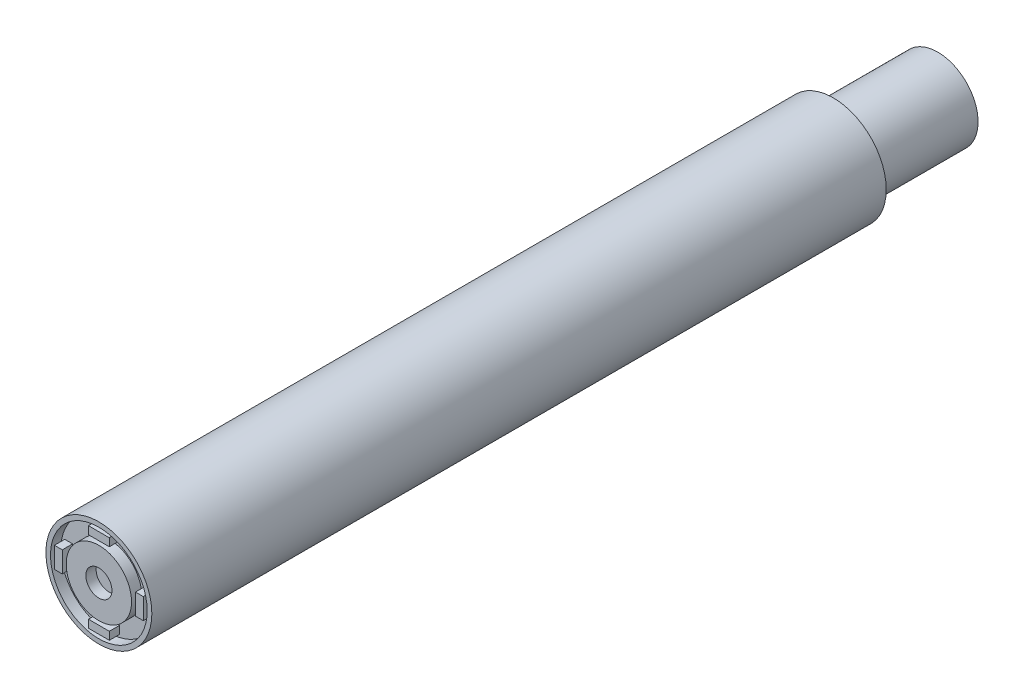
ISO-10303-21;
HEADER;
FILE_DESCRIPTION(('STEP AP214'),'2;1');
FILE_NAME('part.step','',(''),(''),'','','');
FILE_SCHEMA(('AUTOMOTIVE_DESIGN { 1 0 10303 214 1 1 1 1 }'));
ENDSEC;
DATA;
#1=APPLICATION_CONTEXT('core data for automotive mechanical design processes');
#2=APPLICATION_PROTOCOL_DEFINITION('international standard','automotive_design',2000,#1);
#3=PRODUCT_CONTEXT('',#1,'mechanical');
#4=PRODUCT('Part','Part','',(#3));
#5=PRODUCT_RELATED_PRODUCT_CATEGORY('part','',(#4));
#6=PRODUCT_DEFINITION_FORMATION('','',#4);
#7=PRODUCT_DEFINITION_CONTEXT('part definition',#1,'design');
#8=PRODUCT_DEFINITION('design','',#6,#7);
#9=PRODUCT_DEFINITION_SHAPE('','',#8);
#10=(LENGTH_UNIT() NAMED_UNIT(*) SI_UNIT(.MILLI.,.METRE.));
#11=(NAMED_UNIT(*) PLANE_ANGLE_UNIT() SI_UNIT($,.RADIAN.));
#12=(NAMED_UNIT(*) SI_UNIT($,.STERADIAN.) SOLID_ANGLE_UNIT());
#13=UNCERTAINTY_MEASURE_WITH_UNIT(LENGTH_MEASURE(1.E-05),#10,'distance_accuracy_value','');
#14=(GEOMETRIC_REPRESENTATION_CONTEXT(3) GLOBAL_UNCERTAINTY_ASSIGNED_CONTEXT((#13)) GLOBAL_UNIT_ASSIGNED_CONTEXT((#10,
#11,#12)) REPRESENTATION_CONTEXT('',''));
#15=CARTESIAN_POINT('',(0.,0.,0.));
#16=DIRECTION('',(0.,0.,1.));
#17=DIRECTION('',(1.,0.,0.));
#18=AXIS2_PLACEMENT_3D('',#15,#16,#17);
#19=CARTESIAN_POINT('',(0.,0.,-35.7));
#20=DIRECTION('',(0.,0.,1.));
#21=DIRECTION('',(1.,0.,0.));
#22=AXIS2_PLACEMENT_3D('',#19,#20,#21);
#23=CYLINDRICAL_SURFACE('',#22,2.57499999999999);
#24=CARTESIAN_POINT('',(0.,0.,-35.7));
#25=DIRECTION('',(0.,0.,1.));
#26=DIRECTION('',(1.,0.,0.));
#27=AXIS2_PLACEMENT_3D('',#24,#25,#26);
#28=CIRCLE('',#27,2.57499999999999);
#29=CARTESIAN_POINT('',(2.57499999999999,0.,-35.7));
#30=VERTEX_POINT('',#29);
#31=EDGE_CURVE('E298',#30,#30,#28,.T.);
#32=ORIENTED_EDGE('',*,*,#31,.T.);
#33=EDGE_LOOP('',(#32));
#34=FACE_BOUND('',#33,.T.);
#35=CARTESIAN_POINT('',(0.,0.,0.));
#36=DIRECTION('',(0.,0.,1.));
#37=DIRECTION('',(1.,0.,0.));
#38=AXIS2_PLACEMENT_3D('',#35,#36,#37);
#39=CIRCLE('',#38,2.57499999999999);
#40=CARTESIAN_POINT('',(2.57499999999999,0.,0.));
#41=VERTEX_POINT('',#40);
#42=EDGE_CURVE('E293',#41,#41,#39,.T.);
#43=ORIENTED_EDGE('',*,*,#42,.F.);
#44=EDGE_LOOP('',(#43));
#45=FACE_BOUND('',#44,.T.);
#46=ADVANCED_FACE('F41',(#34,#45),#23,.T.);
#47=CARTESIAN_POINT('',(0.,0.,-35.7));
#48=DIRECTION('',(0.,0.,1.));
#49=DIRECTION('',(1.,0.,0.));
#50=AXIS2_PLACEMENT_3D('',#47,#48,#49);
#51=PLANE('',#50);
#52=CARTESIAN_POINT('',(0.,0.,-35.7));
#53=DIRECTION('',(0.,0.,-1.));
#54=DIRECTION('',(-1.,0.,0.));
#55=AXIS2_PLACEMENT_3D('',#52,#53,#54);
#56=CIRCLE('',#55,1.9588);
#57=CARTESIAN_POINT('',(-1.9588,0.,-35.7));
#58=VERTEX_POINT('',#57);
#59=EDGE_CURVE('E11',#58,#58,#56,.T.);
#60=ORIENTED_EDGE('',*,*,#59,.F.);
#61=EDGE_LOOP('',(#60));
#62=FACE_BOUND('',#61,.T.);
#63=ORIENTED_EDGE('',*,*,#31,.F.);
#64=EDGE_LOOP('',(#63));
#65=FACE_BOUND('',#64,.T.);
#66=ADVANCED_FACE('F394',(#62,#65),#51,.F.);
#67=CARTESIAN_POINT('',(0.,0.,0.));
#68=DIRECTION('',(0.,0.,1.));
#69=DIRECTION('',(1.,0.,0.));
#70=AXIS2_PLACEMENT_3D('',#67,#68,#69);
#71=PLANE('',#70);
#72=CARTESIAN_POINT('',(0.,0.,0.));
#73=DIRECTION('',(0.,0.,1.));
#74=DIRECTION('',(1.,0.,0.));
#75=AXIS2_PLACEMENT_3D('',#72,#73,#74);
#76=CIRCLE('',#75,2.35);
#77=CARTESIAN_POINT('',(2.35,0.,0.));
#78=VERTEX_POINT('',#77);
#79=EDGE_CURVE('E294',#78,#78,#76,.T.);
#80=ORIENTED_EDGE('',*,*,#79,.F.);
#81=EDGE_LOOP('',(#80));
#82=FACE_BOUND('',#81,.T.);
#83=ORIENTED_EDGE('',*,*,#42,.T.);
#84=EDGE_LOOP('',(#83));
#85=FACE_BOUND('',#84,.T.);
#86=ADVANCED_FACE('F388',(#82,#85),#71,.T.);
#87=CARTESIAN_POINT('',(0.,0.,-0.5));
#88=DIRECTION('',(0.,0.,1.));
#89=DIRECTION('',(1.,0.,0.));
#90=AXIS2_PLACEMENT_3D('',#87,#88,#89);
#91=CYLINDRICAL_SURFACE('',#90,2.35);
#92=CARTESIAN_POINT('',(0.,0.,-0.5));
#93=DIRECTION('',(0.,0.,1.));
#94=DIRECTION('',(1.,0.,0.));
#95=AXIS2_PLACEMENT_3D('',#92,#93,#94);
#96=CIRCLE('',#95,2.35);
#97=CARTESIAN_POINT('',(2.35,0.,-0.5));
#98=VERTEX_POINT('',#97);
#99=EDGE_CURVE('E289',#98,#98,#96,.T.);
#100=ORIENTED_EDGE('',*,*,#99,.F.);
#101=EDGE_LOOP('',(#100));
#102=FACE_BOUND('',#101,.T.);
#103=ORIENTED_EDGE('',*,*,#79,.T.);
#104=EDGE_LOOP('',(#103));
#105=FACE_BOUND('',#104,.T.);
#106=ADVANCED_FACE('F376',(#102,#105),#91,.F.);
#107=CARTESIAN_POINT('',(0.,0.,-0.5));
#108=DIRECTION('',(0.,0.,1.));
#109=DIRECTION('',(1.,0.,0.));
#110=AXIS2_PLACEMENT_3D('',#107,#108,#109);
#111=PLANE('',#110);
#112=DIRECTION('',(0.,1.,0.));
#113=VECTOR('',#112,1.);
#114=CARTESIAN_POINT('',(2.159,0.,-0.5));
#115=LINE('',#114,#113);
#116=CARTESIAN_POINT('',(2.159,-0.508,-0.5));
#117=VERTEX_POINT('',#116);
#118=CARTESIAN_POINT('',(2.159,0.508,-0.5));
#119=VERTEX_POINT('',#118);
#120=EDGE_CURVE('E44',#117,#119,#115,.T.);
#121=ORIENTED_EDGE('',*,*,#120,.F.);
#122=DIRECTION('',(1.,0.,0.));
#123=VECTOR('',#122,1.);
#124=CARTESIAN_POINT('',(0.,-0.508,-0.5));
#125=LINE('',#124,#123);
#126=CARTESIAN_POINT('',(1.778,-0.508,-0.5));
#127=VERTEX_POINT('',#126);
#128=EDGE_CURVE('E60',#127,#117,#125,.T.);
#129=ORIENTED_EDGE('',*,*,#128,.F.);
#130=DIRECTION('',(0.,-1.,0.));
#131=VECTOR('',#130,1.);
#132=CARTESIAN_POINT('',(1.778,0.,-0.5));
#133=LINE('',#132,#131);
#134=CARTESIAN_POINT('',(1.778,0.508,-0.5));
#135=VERTEX_POINT('',#134);
#136=EDGE_CURVE('E363',#135,#127,#133,.T.);
#137=ORIENTED_EDGE('',*,*,#136,.F.);
#138=DIRECTION('',(-1.,0.,0.));
#139=VECTOR('',#138,1.);
#140=CARTESIAN_POINT('',(0.,0.508,-0.5));
#141=LINE('',#140,#139);
#142=EDGE_CURVE('E360',#119,#135,#141,.T.);
#143=ORIENTED_EDGE('',*,*,#142,.F.);
#144=EDGE_LOOP('',(#121,#129,#137,#143));
#145=FACE_BOUND('',#144,.T.);
#146=DIRECTION('',(0.,1.,0.));
#147=VECTOR('',#146,1.);
#148=CARTESIAN_POINT('',(-1.778,0.,-0.5));
#149=LINE('',#148,#147);
#150=CARTESIAN_POINT('',(-1.778,-0.508,-0.5));
#151=VERTEX_POINT('',#150);
#152=CARTESIAN_POINT('',(-1.778,0.508,-0.5));
#153=VERTEX_POINT('',#152);
#154=EDGE_CURVE('E356',#151,#153,#149,.T.);
#155=ORIENTED_EDGE('',*,*,#154,.F.);
#156=DIRECTION('',(1.,0.,0.));
#157=VECTOR('',#156,1.);
#158=CARTESIAN_POINT('',(0.,-0.508,-0.5));
#159=LINE('',#158,#157);
#160=CARTESIAN_POINT('',(-2.159,-0.508,-0.5));
#161=VERTEX_POINT('',#160);
#162=EDGE_CURVE('E352',#161,#151,#159,.T.);
#163=ORIENTED_EDGE('',*,*,#162,.F.);
#164=DIRECTION('',(0.,-1.,0.));
#165=VECTOR('',#164,1.);
#166=CARTESIAN_POINT('',(-2.159,0.,-0.5));
#167=LINE('',#166,#165);
#168=CARTESIAN_POINT('',(-2.159,0.508,-0.5));
#169=VERTEX_POINT('',#168);
#170=EDGE_CURVE('E348',#169,#161,#167,.T.);
#171=ORIENTED_EDGE('',*,*,#170,.F.);
#172=DIRECTION('',(-1.,0.,0.));
#173=VECTOR('',#172,1.);
#174=CARTESIAN_POINT('',(0.,0.508,-0.5));
#175=LINE('',#174,#173);
#176=EDGE_CURVE('E344',#153,#169,#175,.T.);
#177=ORIENTED_EDGE('',*,*,#176,.F.);
#178=EDGE_LOOP('',(#155,#163,#171,#177));
#179=FACE_BOUND('',#178,.T.);
#180=DIRECTION('',(0.,1.,0.));
#181=VECTOR('',#180,1.);
#182=CARTESIAN_POINT('',(0.508,0.,-0.5));
#183=LINE('',#182,#181);
#184=CARTESIAN_POINT('',(0.508,-2.159,-0.5));
#185=VERTEX_POINT('',#184);
#186=CARTESIAN_POINT('',(0.508,-1.778,-0.5));
#187=VERTEX_POINT('',#186);
#188=EDGE_CURVE('E340',#185,#187,#183,.T.);
#189=ORIENTED_EDGE('',*,*,#188,.F.);
#190=DIRECTION('',(1.,0.,0.));
#191=VECTOR('',#190,1.);
#192=CARTESIAN_POINT('',(0.,-2.159,-0.5));
#193=LINE('',#192,#191);
#194=CARTESIAN_POINT('',(-0.508,-2.159,-0.5));
#195=VERTEX_POINT('',#194);
#196=EDGE_CURVE('E336',#195,#185,#193,.T.);
#197=ORIENTED_EDGE('',*,*,#196,.F.);
#198=DIRECTION('',(0.,-1.,0.));
#199=VECTOR('',#198,1.);
#200=CARTESIAN_POINT('',(-0.508,0.,-0.5));
#201=LINE('',#200,#199);
#202=CARTESIAN_POINT('',(-0.508,-1.778,-0.5));
#203=VERTEX_POINT('',#202);
#204=EDGE_CURVE('E332',#203,#195,#201,.T.);
#205=ORIENTED_EDGE('',*,*,#204,.F.);
#206=DIRECTION('',(-1.,0.,0.));
#207=VECTOR('',#206,1.);
#208=CARTESIAN_POINT('',(0.,-1.778,-0.5));
#209=LINE('',#208,#207);
#210=EDGE_CURVE('E328',#187,#203,#209,.T.);
#211=ORIENTED_EDGE('',*,*,#210,.F.);
#212=EDGE_LOOP('',(#189,#197,#205,#211));
#213=FACE_BOUND('',#212,.T.);
#214=DIRECTION('',(0.,1.,0.));
#215=VECTOR('',#214,1.);
#216=CARTESIAN_POINT('',(0.508000000000001,0.,-0.5));
#217=LINE('',#216,#215);
#218=CARTESIAN_POINT('',(0.508000000000001,1.778,-0.5));
#219=VERTEX_POINT('',#218);
#220=CARTESIAN_POINT('',(0.508000000000001,2.159,-0.5));
#221=VERTEX_POINT('',#220);
#222=EDGE_CURVE('E324',#219,#221,#217,.T.);
#223=ORIENTED_EDGE('',*,*,#222,.F.);
#224=DIRECTION('',(1.,0.,0.));
#225=VECTOR('',#224,1.);
#226=CARTESIAN_POINT('',(0.,1.778,-0.5));
#227=LINE('',#226,#225);
#228=CARTESIAN_POINT('',(-0.507999999999999,1.778,-0.5));
#229=VERTEX_POINT('',#228);
#230=EDGE_CURVE('E320',#229,#219,#227,.T.);
#231=ORIENTED_EDGE('',*,*,#230,.F.);
#232=DIRECTION('',(0.,-1.,0.));
#233=VECTOR('',#232,1.);
#234=CARTESIAN_POINT('',(-0.507999999999999,0.,-0.5));
#235=LINE('',#234,#233);
#236=CARTESIAN_POINT('',(-0.507999999999999,2.159,-0.5));
#237=VERTEX_POINT('',#236);
#238=EDGE_CURVE('E316',#237,#229,#235,.T.);
#239=ORIENTED_EDGE('',*,*,#238,.F.);
#240=DIRECTION('',(-1.,0.,0.));
#241=VECTOR('',#240,1.);
#242=CARTESIAN_POINT('',(0.,2.159,-0.5));
#243=LINE('',#242,#241);
#244=EDGE_CURVE('E312',#221,#237,#243,.T.);
#245=ORIENTED_EDGE('',*,*,#244,.F.);
#246=EDGE_LOOP('',(#223,#231,#239,#245));
#247=FACE_BOUND('',#246,.T.);
#248=CARTESIAN_POINT('',(0.,0.,-0.5));
#249=DIRECTION('',(0.,0.,1.));
#250=DIRECTION('',(1.,0.,0.));
#251=AXIS2_PLACEMENT_3D('',#248,#249,#250);
#252=CIRCLE('',#251,1.5875);
#253=CARTESIAN_POINT('',(1.5875,0.,-0.5));
#254=VERTEX_POINT('',#253);
#255=EDGE_CURVE('E302',#254,#254,#252,.T.);
#256=ORIENTED_EDGE('',*,*,#255,.F.);
#257=EDGE_LOOP('',(#256));
#258=FACE_BOUND('',#257,.T.);
#259=ORIENTED_EDGE('',*,*,#99,.T.);
#260=EDGE_LOOP('',(#259));
#261=FACE_BOUND('',#260,.T.);
#262=ADVANCED_FACE('F372',(#145,#179,#213,#247,#258,#261),#111,.T.);
#263=CARTESIAN_POINT('',(0.,0.,-0.508));
#264=DIRECTION('',(0.,0.,1.));
#265=DIRECTION('',(1.,0.,0.));
#266=AXIS2_PLACEMENT_3D('',#263,#264,#265);
#267=CYLINDRICAL_SURFACE('',#266,1.5875);
#268=ORIENTED_EDGE('',*,*,#255,.T.);
#269=EDGE_LOOP('',(#268));
#270=FACE_BOUND('',#269,.T.);
#271=CARTESIAN_POINT('',(0.,0.,0.));
#272=DIRECTION('',(0.,0.,1.));
#273=DIRECTION('',(1.,0.,0.));
#274=AXIS2_PLACEMENT_3D('',#271,#272,#273);
#275=CIRCLE('',#274,1.5875);
#276=CARTESIAN_POINT('',(1.5875,0.,0.));
#277=VERTEX_POINT('',#276);
#278=EDGE_CURVE('E284',#277,#277,#275,.T.);
#279=ORIENTED_EDGE('',*,*,#278,.F.);
#280=EDGE_LOOP('',(#279));
#281=FACE_BOUND('',#280,.T.);
#282=ADVANCED_FACE('F375',(#270,#281),#267,.T.);
#283=CARTESIAN_POINT('',(0.,0.,0.));
#284=DIRECTION('',(0.,0.,1.));
#285=DIRECTION('',(1.,0.,0.));
#286=AXIS2_PLACEMENT_3D('',#283,#284,#285);
#287=PLANE('',#286);
#288=CARTESIAN_POINT('',(0.,0.,0.));
#289=DIRECTION('',(0.,0.,1.));
#290=DIRECTION('',(1.,0.,0.));
#291=AXIS2_PLACEMENT_3D('',#288,#289,#290);
#292=CIRCLE('',#291,0.635);
#293=CARTESIAN_POINT('',(0.635,0.,0.));
#294=VERTEX_POINT('',#293);
#295=EDGE_CURVE('E272',#294,#294,#292,.T.);
#296=ORIENTED_EDGE('',*,*,#295,.F.);
#297=EDGE_LOOP('',(#296));
#298=FACE_BOUND('',#297,.T.);
#299=ORIENTED_EDGE('',*,*,#278,.T.);
#300=EDGE_LOOP('',(#299));
#301=FACE_BOUND('',#300,.T.);
#302=ADVANCED_FACE('F412',(#298,#301),#287,.T.);
#303=CARTESIAN_POINT('',(0.,0.,-0.508));
#304=DIRECTION('',(0.,0.,1.));
#305=DIRECTION('',(1.,0.,0.));
#306=AXIS2_PLACEMENT_3D('',#303,#304,#305);
#307=CYLINDRICAL_SURFACE('',#306,0.635);
#308=CARTESIAN_POINT('',(0.,0.,-0.5));
#309=DIRECTION('',(0.,0.,1.));
#310=DIRECTION('',(1.,0.,0.));
#311=AXIS2_PLACEMENT_3D('',#308,#309,#310);
#312=CIRCLE('',#311,0.635);
#313=CARTESIAN_POINT('',(0.635,0.,-0.5));
#314=VERTEX_POINT('',#313);
#315=EDGE_CURVE('E288',#314,#314,#312,.T.);
#316=ORIENTED_EDGE('',*,*,#315,.F.);
#317=EDGE_LOOP('',(#316));
#318=FACE_BOUND('',#317,.T.);
#319=ORIENTED_EDGE('',*,*,#295,.T.);
#320=EDGE_LOOP('',(#319));
#321=FACE_BOUND('',#320,.T.);
#322=ADVANCED_FACE('F416',(#318,#321),#307,.F.);
#323=ORIENTED_EDGE('',*,*,#315,.T.);
#324=EDGE_LOOP('',(#323));
#325=FACE_BOUND('',#324,.T.);
#326=ADVANCED_FACE('F378',(#325),#111,.T.);
#327=CARTESIAN_POINT('',(0.508000000000001,1.778,-0.508));
#328=DIRECTION('',(1.,0.,0.));
#329=DIRECTION('',(0.,0.,-1.));
#330=AXIS2_PLACEMENT_3D('',#327,#328,#329);
#331=PLANE('',#330);
#332=DIRECTION('',(0.,0.,1.));
#333=VECTOR('',#332,1.);
#334=CARTESIAN_POINT('',(0.508000000000001,1.778,-0.508));
#335=LINE('',#334,#333);
#336=CARTESIAN_POINT('',(0.508000000000001,1.778,0.));
#337=VERTEX_POINT('',#336);
#338=EDGE_CURVE('E269',#219,#337,#335,.T.);
#339=ORIENTED_EDGE('',*,*,#338,.F.);
#340=ORIENTED_EDGE('',*,*,#222,.T.);
#341=DIRECTION('',(0.,0.,1.));
#342=VECTOR('',#341,1.);
#343=CARTESIAN_POINT('',(0.508000000000001,2.159,-0.508));
#344=LINE('',#343,#342);
#345=CARTESIAN_POINT('',(0.508000000000001,2.159,0.));
#346=VERTEX_POINT('',#345);
#347=EDGE_CURVE('E268',#221,#346,#344,.T.);
#348=ORIENTED_EDGE('',*,*,#347,.T.);
#349=DIRECTION('',(0.,1.,0.));
#350=VECTOR('',#349,1.);
#351=CARTESIAN_POINT('',(0.508000000000001,1.778,0.));
#352=LINE('',#351,#350);
#353=EDGE_CURVE('E244',#337,#346,#352,.T.);
#354=ORIENTED_EDGE('',*,*,#353,.F.);
#355=EDGE_LOOP('',(#339,#340,#348,#354));
#356=FACE_BOUND('',#355,.T.);
#357=ADVANCED_FACE('F421',(#356),#331,.T.);
#358=CARTESIAN_POINT('',(-0.507999999999999,1.778,-0.508));
#359=DIRECTION('',(0.,-1.,0.));
#360=DIRECTION('',(0.,0.,-1.));
#361=AXIS2_PLACEMENT_3D('',#358,#359,#360);
#362=PLANE('',#361);
#363=DIRECTION('',(0.,0.,1.));
#364=VECTOR('',#363,1.);
#365=CARTESIAN_POINT('',(-0.507999999999999,1.778,-0.508));
#366=LINE('',#365,#364);
#367=CARTESIAN_POINT('',(-0.507999999999999,1.778,0.));
#368=VERTEX_POINT('',#367);
#369=EDGE_CURVE('E273',#229,#368,#366,.T.);
#370=ORIENTED_EDGE('',*,*,#369,.F.);
#371=ORIENTED_EDGE('',*,*,#230,.T.);
#372=ORIENTED_EDGE('',*,*,#338,.T.);
#373=DIRECTION('',(1.,0.,0.));
#374=VECTOR('',#373,1.);
#375=CARTESIAN_POINT('',(-0.507999999999999,1.778,0.));
#376=LINE('',#375,#374);
#377=EDGE_CURVE('E264',#368,#337,#376,.T.);
#378=ORIENTED_EDGE('',*,*,#377,.F.);
#379=EDGE_LOOP('',(#370,#371,#372,#378));
#380=FACE_BOUND('',#379,.T.);
#381=ADVANCED_FACE('F424',(#380),#362,.T.);
#382=CARTESIAN_POINT('',(-0.507999999999999,1.778,-0.508));
#383=DIRECTION('',(-1.,0.,0.));
#384=DIRECTION('',(0.,0.,1.));
#385=AXIS2_PLACEMENT_3D('',#382,#383,#384);
#386=PLANE('',#385);
#387=DIRECTION('',(0.,0.,1.));
#388=VECTOR('',#387,1.);
#389=CARTESIAN_POINT('',(-0.507999999999999,2.159,-0.508));
#390=LINE('',#389,#388);
#391=CARTESIAN_POINT('',(-0.507999999999999,2.159,0.));
#392=VERTEX_POINT('',#391);
#393=EDGE_CURVE('E276',#237,#392,#390,.T.);
#394=ORIENTED_EDGE('',*,*,#393,.F.);
#395=ORIENTED_EDGE('',*,*,#238,.T.);
#396=ORIENTED_EDGE('',*,*,#369,.T.);
#397=DIRECTION('',(0.,-1.,0.));
#398=VECTOR('',#397,1.);
#399=CARTESIAN_POINT('',(-0.507999999999999,1.778,0.));
#400=LINE('',#399,#398);
#401=EDGE_CURVE('E260',#392,#368,#400,.T.);
#402=ORIENTED_EDGE('',*,*,#401,.F.);
#403=EDGE_LOOP('',(#394,#395,#396,#402));
#404=FACE_BOUND('',#403,.T.);
#405=ADVANCED_FACE('F430',(#404),#386,.T.);
#406=CARTESIAN_POINT('',(-0.507999999999999,2.159,-0.508));
#407=DIRECTION('',(0.,1.,0.));
#408=DIRECTION('',(0.,0.,1.));
#409=AXIS2_PLACEMENT_3D('',#406,#407,#408);
#410=PLANE('',#409);
#411=ORIENTED_EDGE('',*,*,#347,.F.);
#412=ORIENTED_EDGE('',*,*,#244,.T.);
#413=ORIENTED_EDGE('',*,*,#393,.T.);
#414=DIRECTION('',(-1.,0.,0.));
#415=VECTOR('',#414,1.);
#416=CARTESIAN_POINT('',(-0.507999999999999,2.159,0.));
#417=LINE('',#416,#415);
#418=EDGE_CURVE('E256',#346,#392,#417,.T.);
#419=ORIENTED_EDGE('',*,*,#418,.F.);
#420=EDGE_LOOP('',(#411,#412,#413,#419));
#421=FACE_BOUND('',#420,.T.);
#422=ADVANCED_FACE('F426',(#421),#410,.T.);
#423=CARTESIAN_POINT('',(0.,0.,0.));
#424=DIRECTION('',(0.,0.,-1.));
#425=DIRECTION('',(-1.,0.,0.));
#426=AXIS2_PLACEMENT_3D('',#423,#424,#425);
#427=PLANE('',#426);
#428=ORIENTED_EDGE('',*,*,#353,.T.);
#429=ORIENTED_EDGE('',*,*,#418,.T.);
#430=ORIENTED_EDGE('',*,*,#401,.T.);
#431=ORIENTED_EDGE('',*,*,#377,.T.);
#432=EDGE_LOOP('',(#428,#429,#430,#431));
#433=FACE_BOUND('',#432,.T.);
#434=ADVANCED_FACE('F429',(#433),#427,.F.);
#435=CARTESIAN_POINT('',(0.508,-2.159,-0.508));
#436=DIRECTION('',(1.,0.,0.));
#437=DIRECTION('',(0.,0.,-1.));
#438=AXIS2_PLACEMENT_3D('',#435,#436,#437);
#439=PLANE('',#438);
#440=DIRECTION('',(0.,0.,1.));
#441=VECTOR('',#440,1.);
#442=CARTESIAN_POINT('',(0.508,-2.159,-0.508));
#443=LINE('',#442,#441);
#444=CARTESIAN_POINT('',(0.508,-2.159,0.));
#445=VERTEX_POINT('',#444);
#446=EDGE_CURVE('E241',#185,#445,#443,.T.);
#447=ORIENTED_EDGE('',*,*,#446,.F.);
#448=ORIENTED_EDGE('',*,*,#188,.T.);
#449=DIRECTION('',(0.,0.,1.));
#450=VECTOR('',#449,1.);
#451=CARTESIAN_POINT('',(0.508,-1.778,-0.508));
#452=LINE('',#451,#450);
#453=CARTESIAN_POINT('',(0.508,-1.778,0.));
#454=VERTEX_POINT('',#453);
#455=EDGE_CURVE('E240',#187,#454,#452,.T.);
#456=ORIENTED_EDGE('',*,*,#455,.T.);
#457=DIRECTION('',(0.,1.,0.));
#458=VECTOR('',#457,1.);
#459=CARTESIAN_POINT('',(0.508,-2.159,0.));
#460=LINE('',#459,#458);
#461=EDGE_CURVE('E216',#445,#454,#460,.T.);
#462=ORIENTED_EDGE('',*,*,#461,.F.);
#463=EDGE_LOOP('',(#447,#448,#456,#462));
#464=FACE_BOUND('',#463,.T.);
#465=ADVANCED_FACE('F440',(#464),#439,.T.);
#466=CARTESIAN_POINT('',(-0.508,-2.159,-0.508));
#467=DIRECTION('',(0.,-1.,0.));
#468=DIRECTION('',(0.,0.,-1.));
#469=AXIS2_PLACEMENT_3D('',#466,#467,#468);
#470=PLANE('',#469);
#471=DIRECTION('',(0.,0.,1.));
#472=VECTOR('',#471,1.);
#473=CARTESIAN_POINT('',(-0.508,-2.159,-0.508));
#474=LINE('',#473,#472);
#475=CARTESIAN_POINT('',(-0.508,-2.159,0.));
#476=VERTEX_POINT('',#475);
#477=EDGE_CURVE('E245',#195,#476,#474,.T.);
#478=ORIENTED_EDGE('',*,*,#477,.F.);
#479=ORIENTED_EDGE('',*,*,#196,.T.);
#480=ORIENTED_EDGE('',*,*,#446,.T.);
#481=DIRECTION('',(1.,0.,0.));
#482=VECTOR('',#481,1.);
#483=CARTESIAN_POINT('',(-0.508,-2.159,0.));
#484=LINE('',#483,#482);
#485=EDGE_CURVE('E236',#476,#445,#484,.T.);
#486=ORIENTED_EDGE('',*,*,#485,.F.);
#487=EDGE_LOOP('',(#478,#479,#480,#486));
#488=FACE_BOUND('',#487,.T.);
#489=ADVANCED_FACE('F444',(#488),#470,.T.);
#490=CARTESIAN_POINT('',(-0.508,-2.159,-0.508));
#491=DIRECTION('',(-1.,0.,0.));
#492=DIRECTION('',(0.,0.,1.));
#493=AXIS2_PLACEMENT_3D('',#490,#491,#492);
#494=PLANE('',#493);
#495=DIRECTION('',(0.,0.,1.));
#496=VECTOR('',#495,1.);
#497=CARTESIAN_POINT('',(-0.508,-1.778,-0.508));
#498=LINE('',#497,#496);
#499=CARTESIAN_POINT('',(-0.508,-1.778,0.));
#500=VERTEX_POINT('',#499);
#501=EDGE_CURVE('E248',#203,#500,#498,.T.);
#502=ORIENTED_EDGE('',*,*,#501,.F.);
#503=ORIENTED_EDGE('',*,*,#204,.T.);
#504=ORIENTED_EDGE('',*,*,#477,.T.);
#505=DIRECTION('',(0.,-1.,0.));
#506=VECTOR('',#505,1.);
#507=CARTESIAN_POINT('',(-0.508,-2.159,0.));
#508=LINE('',#507,#506);
#509=EDGE_CURVE('E232',#500,#476,#508,.T.);
#510=ORIENTED_EDGE('',*,*,#509,.F.);
#511=EDGE_LOOP('',(#502,#503,#504,#510));
#512=FACE_BOUND('',#511,.T.);
#513=ADVANCED_FACE('F450',(#512),#494,.T.);
#514=CARTESIAN_POINT('',(-0.508,-1.778,-0.508));
#515=DIRECTION('',(0.,1.,0.));
#516=DIRECTION('',(0.,0.,1.));
#517=AXIS2_PLACEMENT_3D('',#514,#515,#516);
#518=PLANE('',#517);
#519=ORIENTED_EDGE('',*,*,#455,.F.);
#520=ORIENTED_EDGE('',*,*,#210,.T.);
#521=ORIENTED_EDGE('',*,*,#501,.T.);
#522=DIRECTION('',(-1.,0.,0.));
#523=VECTOR('',#522,1.);
#524=CARTESIAN_POINT('',(-0.508,-1.778,0.));
#525=LINE('',#524,#523);
#526=EDGE_CURVE('E228',#454,#500,#525,.T.);
#527=ORIENTED_EDGE('',*,*,#526,.F.);
#528=EDGE_LOOP('',(#519,#520,#521,#527));
#529=FACE_BOUND('',#528,.T.);
#530=ADVANCED_FACE('F446',(#529),#518,.T.);
#531=CARTESIAN_POINT('',(0.,0.,0.));
#532=DIRECTION('',(0.,0.,-1.));
#533=DIRECTION('',(-1.,0.,0.));
#534=AXIS2_PLACEMENT_3D('',#531,#532,#533);
#535=PLANE('',#534);
#536=ORIENTED_EDGE('',*,*,#461,.T.);
#537=ORIENTED_EDGE('',*,*,#526,.T.);
#538=ORIENTED_EDGE('',*,*,#509,.T.);
#539=ORIENTED_EDGE('',*,*,#485,.T.);
#540=EDGE_LOOP('',(#536,#537,#538,#539));
#541=FACE_BOUND('',#540,.T.);
#542=ADVANCED_FACE('F449',(#541),#535,.F.);
#543=CARTESIAN_POINT('',(-1.778,-0.508,-0.508));
#544=DIRECTION('',(1.,0.,0.));
#545=DIRECTION('',(0.,0.,-1.));
#546=AXIS2_PLACEMENT_3D('',#543,#544,#545);
#547=PLANE('',#546);
#548=DIRECTION('',(0.,0.,1.));
#549=VECTOR('',#548,1.);
#550=CARTESIAN_POINT('',(-1.778,-0.508,-0.508));
#551=LINE('',#550,#549);
#552=CARTESIAN_POINT('',(-1.778,-0.508,0.));
#553=VERTEX_POINT('',#552);
#554=EDGE_CURVE('E213',#151,#553,#551,.T.);
#555=ORIENTED_EDGE('',*,*,#554,.F.);
#556=ORIENTED_EDGE('',*,*,#154,.T.);
#557=DIRECTION('',(0.,0.,1.));
#558=VECTOR('',#557,1.);
#559=CARTESIAN_POINT('',(-1.778,0.508,-0.508));
#560=LINE('',#559,#558);
#561=CARTESIAN_POINT('',(-1.778,0.508,0.));
#562=VERTEX_POINT('',#561);
#563=EDGE_CURVE('E212',#153,#562,#560,.T.);
#564=ORIENTED_EDGE('',*,*,#563,.T.);
#565=DIRECTION('',(0.,1.,0.));
#566=VECTOR('',#565,1.);
#567=CARTESIAN_POINT('',(-1.778,-0.508,0.));
#568=LINE('',#567,#566);
#569=EDGE_CURVE('E191',#553,#562,#568,.T.);
#570=ORIENTED_EDGE('',*,*,#569,.F.);
#571=EDGE_LOOP('',(#555,#556,#564,#570));
#572=FACE_BOUND('',#571,.T.);
#573=ADVANCED_FACE('F460',(#572),#547,.T.);
#574=CARTESIAN_POINT('',(-2.159,-0.508,-0.508));
#575=DIRECTION('',(0.,-1.,0.));
#576=DIRECTION('',(0.,0.,-1.));
#577=AXIS2_PLACEMENT_3D('',#574,#575,#576);
#578=PLANE('',#577);
#579=DIRECTION('',(0.,0.,1.));
#580=VECTOR('',#579,1.);
#581=CARTESIAN_POINT('',(-2.159,-0.508,-0.508));
#582=LINE('',#581,#580);
#583=CARTESIAN_POINT('',(-2.159,-0.508,0.));
#584=VERTEX_POINT('',#583);
#585=EDGE_CURVE('E217',#161,#584,#582,.T.);
#586=ORIENTED_EDGE('',*,*,#585,.F.);
#587=ORIENTED_EDGE('',*,*,#162,.T.);
#588=ORIENTED_EDGE('',*,*,#554,.T.);
#589=DIRECTION('',(1.,0.,0.));
#590=VECTOR('',#589,1.);
#591=CARTESIAN_POINT('',(-2.159,-0.508,0.));
#592=LINE('',#591,#590);
#593=EDGE_CURVE('E208',#584,#553,#592,.T.);
#594=ORIENTED_EDGE('',*,*,#593,.F.);
#595=EDGE_LOOP('',(#586,#587,#588,#594));
#596=FACE_BOUND('',#595,.T.);
#597=ADVANCED_FACE('F464',(#596),#578,.T.);
#598=CARTESIAN_POINT('',(-2.159,-0.508,-0.508));
#599=DIRECTION('',(-1.,0.,0.));
#600=DIRECTION('',(0.,0.,1.));
#601=AXIS2_PLACEMENT_3D('',#598,#599,#600);
#602=PLANE('',#601);
#603=DIRECTION('',(0.,0.,1.));
#604=VECTOR('',#603,1.);
#605=CARTESIAN_POINT('',(-2.159,0.508,-0.508));
#606=LINE('',#605,#604);
#607=CARTESIAN_POINT('',(-2.159,0.508,0.));
#608=VERTEX_POINT('',#607);
#609=EDGE_CURVE('E220',#169,#608,#606,.T.);
#610=ORIENTED_EDGE('',*,*,#609,.F.);
#611=ORIENTED_EDGE('',*,*,#170,.T.);
#612=ORIENTED_EDGE('',*,*,#585,.T.);
#613=DIRECTION('',(0.,-1.,0.));
#614=VECTOR('',#613,1.);
#615=CARTESIAN_POINT('',(-2.159,-0.508,0.));
#616=LINE('',#615,#614);
#617=EDGE_CURVE('E204',#608,#584,#616,.T.);
#618=ORIENTED_EDGE('',*,*,#617,.F.);
#619=EDGE_LOOP('',(#610,#611,#612,#618));
#620=FACE_BOUND('',#619,.T.);
#621=ADVANCED_FACE('F470',(#620),#602,.T.);
#622=CARTESIAN_POINT('',(-2.159,0.508,-0.508));
#623=DIRECTION('',(0.,1.,0.));
#624=DIRECTION('',(0.,0.,1.));
#625=AXIS2_PLACEMENT_3D('',#622,#623,#624);
#626=PLANE('',#625);
#627=ORIENTED_EDGE('',*,*,#563,.F.);
#628=ORIENTED_EDGE('',*,*,#176,.T.);
#629=ORIENTED_EDGE('',*,*,#609,.T.);
#630=DIRECTION('',(-1.,0.,0.));
#631=VECTOR('',#630,1.);
#632=CARTESIAN_POINT('',(-2.159,0.508,0.));
#633=LINE('',#632,#631);
#634=EDGE_CURVE('E200',#562,#608,#633,.T.);
#635=ORIENTED_EDGE('',*,*,#634,.F.);
#636=EDGE_LOOP('',(#627,#628,#629,#635));
#637=FACE_BOUND('',#636,.T.);
#638=ADVANCED_FACE('F466',(#637),#626,.T.);
#639=CARTESIAN_POINT('',(0.,0.,0.));
#640=DIRECTION('',(0.,0.,-1.));
#641=DIRECTION('',(-1.,0.,0.));
#642=AXIS2_PLACEMENT_3D('',#639,#640,#641);
#643=PLANE('',#642);
#644=ORIENTED_EDGE('',*,*,#569,.T.);
#645=ORIENTED_EDGE('',*,*,#634,.T.);
#646=ORIENTED_EDGE('',*,*,#617,.T.);
#647=ORIENTED_EDGE('',*,*,#593,.T.);
#648=EDGE_LOOP('',(#644,#645,#646,#647));
#649=FACE_BOUND('',#648,.T.);
#650=ADVANCED_FACE('F469',(#649),#643,.F.);
#651=CARTESIAN_POINT('',(2.159,-0.508,-0.508));
#652=DIRECTION('',(1.,0.,0.));
#653=DIRECTION('',(0.,0.,-1.));
#654=AXIS2_PLACEMENT_3D('',#651,#652,#653);
#655=PLANE('',#654);
#656=DIRECTION('',(0.,0.,1.));
#657=VECTOR('',#656,1.);
#658=CARTESIAN_POINT('',(2.159,-0.508,-0.508));
#659=LINE('',#658,#657);
#660=CARTESIAN_POINT('',(2.159,-0.508,0.));
#661=VERTEX_POINT('',#660);
#662=EDGE_CURVE('E188',#117,#661,#659,.T.);
#663=ORIENTED_EDGE('',*,*,#662,.F.);
#664=ORIENTED_EDGE('',*,*,#120,.T.);
#665=DIRECTION('',(0.,0.,1.));
#666=VECTOR('',#665,1.);
#667=CARTESIAN_POINT('',(2.159,0.508,-0.508));
#668=LINE('',#667,#666);
#669=CARTESIAN_POINT('',(2.159,0.508,0.));
#670=VERTEX_POINT('',#669);
#671=EDGE_CURVE('E152',#119,#670,#668,.T.);
#672=ORIENTED_EDGE('',*,*,#671,.T.);
#673=DIRECTION('',(0.,1.,0.));
#674=VECTOR('',#673,1.);
#675=CARTESIAN_POINT('',(2.159,-0.508,0.));
#676=LINE('',#675,#674);
#677=EDGE_CURVE('E157',#661,#670,#676,.T.);
#678=ORIENTED_EDGE('',*,*,#677,.F.);
#679=EDGE_LOOP('',(#663,#664,#672,#678));
#680=FACE_BOUND('',#679,.T.);
#681=ADVANCED_FACE('F155',(#680),#655,.T.);
#682=CARTESIAN_POINT('',(1.778,-0.508,-0.508));
#683=DIRECTION('',(0.,-1.,0.));
#684=DIRECTION('',(0.,0.,-1.));
#685=AXIS2_PLACEMENT_3D('',#682,#683,#684);
#686=PLANE('',#685);
#687=DIRECTION('',(0.,0.,1.));
#688=VECTOR('',#687,1.);
#689=CARTESIAN_POINT('',(1.778,-0.508,-0.508));
#690=LINE('',#689,#688);
#691=CARTESIAN_POINT('',(1.778,-0.508,0.));
#692=VERTEX_POINT('',#691);
#693=EDGE_CURVE('E192',#127,#692,#690,.T.);
#694=ORIENTED_EDGE('',*,*,#693,.F.);
#695=ORIENTED_EDGE('',*,*,#128,.T.);
#696=ORIENTED_EDGE('',*,*,#662,.T.);
#697=DIRECTION('',(1.,0.,0.));
#698=VECTOR('',#697,1.);
#699=CARTESIAN_POINT('',(1.778,-0.508,0.));
#700=LINE('',#699,#698);
#701=EDGE_CURVE('E163',#692,#661,#700,.T.);
#702=ORIENTED_EDGE('',*,*,#701,.F.);
#703=EDGE_LOOP('',(#694,#695,#696,#702));
#704=FACE_BOUND('',#703,.T.);
#705=ADVANCED_FACE('F369',(#704),#686,.T.);
#706=CARTESIAN_POINT('',(1.778,-0.508,-0.508));
#707=DIRECTION('',(-1.,0.,0.));
#708=DIRECTION('',(0.,0.,1.));
#709=AXIS2_PLACEMENT_3D('',#706,#707,#708);
#710=PLANE('',#709);
#711=DIRECTION('',(0.,0.,1.));
#712=VECTOR('',#711,1.);
#713=CARTESIAN_POINT('',(1.778,0.508,-0.508));
#714=LINE('',#713,#712);
#715=CARTESIAN_POINT('',(1.778,0.508,0.));
#716=VERTEX_POINT('',#715);
#717=EDGE_CURVE('E162',#135,#716,#714,.T.);
#718=ORIENTED_EDGE('',*,*,#717,.F.);
#719=ORIENTED_EDGE('',*,*,#136,.T.);
#720=ORIENTED_EDGE('',*,*,#693,.T.);
#721=DIRECTION('',(0.,-1.,0.));
#722=VECTOR('',#721,1.);
#723=CARTESIAN_POINT('',(1.778,-0.508,0.));
#724=LINE('',#723,#722);
#725=EDGE_CURVE('E173',#716,#692,#724,.T.);
#726=ORIENTED_EDGE('',*,*,#725,.F.);
#727=EDGE_LOOP('',(#718,#719,#720,#726));
#728=FACE_BOUND('',#727,.T.);
#729=ADVANCED_FACE('F371',(#728),#710,.T.);
#730=CARTESIAN_POINT('',(1.778,0.508,-0.508));
#731=DIRECTION('',(0.,1.,0.));
#732=DIRECTION('',(0.,0.,1.));
#733=AXIS2_PLACEMENT_3D('',#730,#731,#732);
#734=PLANE('',#733);
#735=ORIENTED_EDGE('',*,*,#671,.F.);
#736=ORIENTED_EDGE('',*,*,#142,.T.);
#737=ORIENTED_EDGE('',*,*,#717,.T.);
#738=DIRECTION('',(-1.,0.,0.));
#739=VECTOR('',#738,1.);
#740=CARTESIAN_POINT('',(1.778,0.508,0.));
#741=LINE('',#740,#739);
#742=EDGE_CURVE('E166',#670,#716,#741,.T.);
#743=ORIENTED_EDGE('',*,*,#742,.F.);
#744=EDGE_LOOP('',(#735,#736,#737,#743));
#745=FACE_BOUND('',#744,.T.);
#746=ADVANCED_FACE('F167',(#745),#734,.T.);
#747=CARTESIAN_POINT('',(0.,0.,0.));
#748=DIRECTION('',(0.,0.,-1.));
#749=DIRECTION('',(-1.,0.,0.));
#750=AXIS2_PLACEMENT_3D('',#747,#748,#749);
#751=PLANE('',#750);
#752=ORIENTED_EDGE('',*,*,#677,.T.);
#753=ORIENTED_EDGE('',*,*,#742,.T.);
#754=ORIENTED_EDGE('',*,*,#725,.T.);
#755=ORIENTED_EDGE('',*,*,#701,.T.);
#756=EDGE_LOOP('',(#752,#753,#754,#755));
#757=FACE_BOUND('',#756,.T.);
#758=ADVANCED_FACE('F175',(#757),#751,.F.);
#759=CARTESIAN_POINT('',(0.,0.,-40.78));
#760=DIRECTION('',(0.,0.,1.));
#761=DIRECTION('',(1.,0.,0.));
#762=AXIS2_PLACEMENT_3D('',#759,#760,#761);
#763=CYLINDRICAL_SURFACE('',#762,1.9588);
#764=CARTESIAN_POINT('',(0.,0.,-40.78));
#765=DIRECTION('',(0.,0.,-1.));
#766=DIRECTION('',(-1.,0.,0.));
#767=AXIS2_PLACEMENT_3D('',#764,#765,#766);
#768=CIRCLE('',#767,1.9588);
#769=CARTESIAN_POINT('',(-1.9588,0.,-40.78));
#770=VERTEX_POINT('',#769);
#771=EDGE_CURVE('E178',#770,#770,#768,.T.);
#772=ORIENTED_EDGE('',*,*,#771,.F.);
#773=EDGE_LOOP('',(#772));
#774=FACE_BOUND('',#773,.T.);
#775=ORIENTED_EDGE('',*,*,#59,.T.);
#776=EDGE_LOOP('',(#775));
#777=FACE_BOUND('',#776,.T.);
#778=ADVANCED_FACE('F491',(#774,#777),#763,.T.);
#779=CARTESIAN_POINT('',(0.,0.,-40.78));
#780=DIRECTION('',(0.,0.,-1.));
#781=DIRECTION('',(-1.,0.,0.));
#782=AXIS2_PLACEMENT_3D('',#779,#780,#781);
#783=PLANE('',#782);
#784=ORIENTED_EDGE('',*,*,#771,.T.);
#785=EDGE_LOOP('',(#784));
#786=FACE_BOUND('',#785,.T.);
#787=ADVANCED_FACE('F494',(#786),#783,.T.);
#788=CLOSED_SHELL('',(#46,#66,#86,#106,#262,#282,#302,#322,#326,#357,#381,#405,#422,#434,#465,
#489,#513,#530,#542,#573,#597,#621,#638,#650,#681,#705,#729,#746,#758,#778,#787));
#789=MANIFOLD_SOLID_BREP('B2',#788);
#790=ADVANCED_BREP_SHAPE_REPRESENTATION('',(#18,#789),#14);
#791=SHAPE_DEFINITION_REPRESENTATION(#9,#790);
ENDSEC;
END-ISO-10303-21;
